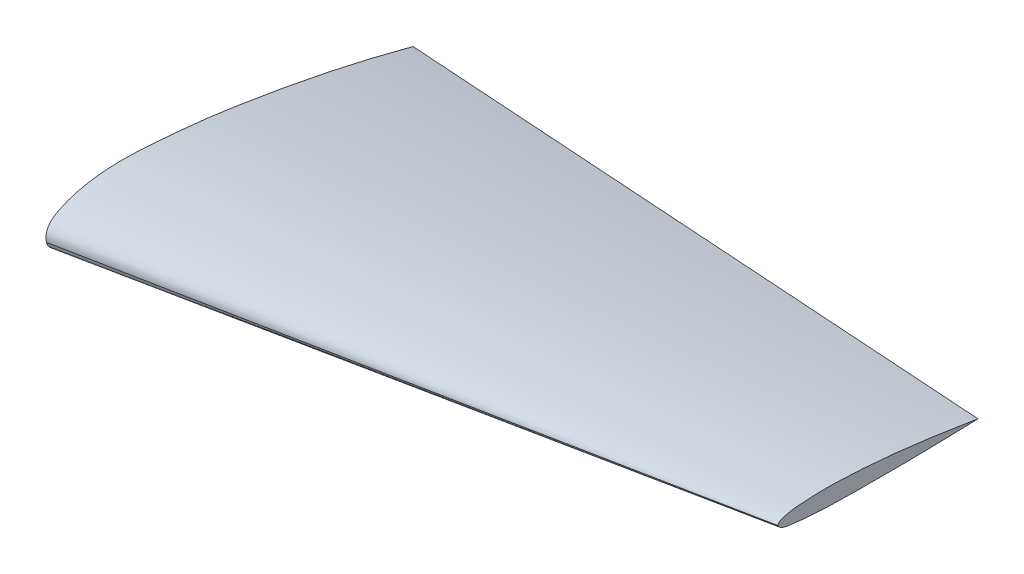
ISO-10303-21;
HEADER;
FILE_DESCRIPTION(('STEP AP214'),'2;1');
FILE_NAME('part.step','',(''),(''),'','','');
FILE_SCHEMA(('AUTOMOTIVE_DESIGN { 1 0 10303 214 1 1 1 1 }'));
ENDSEC;
DATA;
#1=APPLICATION_CONTEXT('core data for automotive mechanical design processes');
#2=APPLICATION_PROTOCOL_DEFINITION('international standard','automotive_design',2000,#1);
#3=PRODUCT_CONTEXT('',#1,'mechanical');
#4=PRODUCT('Part','Part','',(#3));
#5=PRODUCT_RELATED_PRODUCT_CATEGORY('part','',(#4));
#6=PRODUCT_DEFINITION_FORMATION('','',#4);
#7=PRODUCT_DEFINITION_CONTEXT('part definition',#1,'design');
#8=PRODUCT_DEFINITION('design','',#6,#7);
#9=PRODUCT_DEFINITION_SHAPE('','',#8);
#10=(LENGTH_UNIT() NAMED_UNIT(*) SI_UNIT(.MILLI.,.METRE.));
#11=(NAMED_UNIT(*) PLANE_ANGLE_UNIT() SI_UNIT($,.RADIAN.));
#12=(NAMED_UNIT(*) SI_UNIT($,.STERADIAN.) SOLID_ANGLE_UNIT());
#13=UNCERTAINTY_MEASURE_WITH_UNIT(LENGTH_MEASURE(1.E-05),#10,'distance_accuracy_value','');
#14=(GEOMETRIC_REPRESENTATION_CONTEXT(3) GLOBAL_UNCERTAINTY_ASSIGNED_CONTEXT((#13)) GLOBAL_UNIT_ASSIGNED_CONTEXT((#10,
#11,#12)) REPRESENTATION_CONTEXT('',''));
#15=CARTESIAN_POINT('',(0.,0.,0.));
#16=DIRECTION('',(0.,0.,1.));
#17=DIRECTION('',(1.,0.,0.));
#18=AXIS2_PLACEMENT_3D('',#15,#16,#17);
#19=CARTESIAN_POINT('',(497.812961596189,46.8598992347078,-41.7997404423216));
#20=DIRECTION('',(-0.994880708828789,-0.101056297182943,0.));
#21=DIRECTION('',(0.101056297182943,-0.994880708828789,0.));
#22=AXIS2_PLACEMENT_3D('',#19,#20,#21);
#23=PLANE('',#22);
#24=CARTESIAN_POINT('',(497.565765082102,49.293503572191,-39.1503361906483));
#25=CARTESIAN_POINT('',(497.874664280768,46.2524476232544,-40.3563670015449));
#26=CARTESIAN_POINT('',(497.936752741116,45.6411981201315,-47.3358915755482));
#27=B_SPLINE_CURVE_WITH_KNOTS('',2,(#24,#25,#26),.UNSPECIFIED.,.F.,.F.,(3,3),(0.,1.),.UNSPECIFIED.);
#28=CARTESIAN_POINT('',(497.565765082102,49.293503572191,-39.1503361906483));
#29=VERTEX_POINT('',#28);
#30=CARTESIAN_POINT('',(497.936752741116,45.6411981201315,-47.3358915755482));
#31=VERTEX_POINT('',#30);
#32=EDGE_CURVE('E132',#29,#31,#27,.T.);
#33=ORIENTED_EDGE('',*,*,#32,.T.);
#34=CARTESIAN_POINT('',(497.936752741116,45.6411981201315,-47.3358915755482));
#35=CARTESIAN_POINT('',(498.035859563674,44.6655096313851,-53.9145226808806));
#36=CARTESIAN_POINT('',(498.155969729885,43.4830470770631,-69.2736720951361));
#37=CARTESIAN_POINT('',(498.248813242058,42.5690197301683,-115.379755581491));
#38=CARTESIAN_POINT('',(498.175857150927,43.2872590648873,-154.843733905706));
#39=CARTESIAN_POINT('',(498.085240476994,44.1793635977852,-185.550116988422));
#40=B_SPLINE_CURVE_WITH_KNOTS('',3,(#34,#35,#36,#37,#38,#39),.UNSPECIFIED.,.F.,.F.,(4,1,1,4),
(0.,0.144207120424887,0.333735958857241,1.),.UNSPECIFIED.);
#41=CARTESIAN_POINT('',(498.085240476994,44.1793635977852,-185.550116988422));
#42=VERTEX_POINT('',#41);
#43=EDGE_CURVE('E96',#31,#42,#40,.T.);
#44=ORIENTED_EDGE('',*,*,#43,.T.);
#45=CARTESIAN_POINT('',(498.085240476994,44.1793635977852,-185.550116988422));
#46=CARTESIAN_POINT('',(497.58137622044,49.1398147788292,-153.150247387652));
#47=CARTESIAN_POINT('',(497.084942188327,54.0271167632032,-114.367952862237));
#48=CARTESIAN_POINT('',(496.99388070064,54.9236004059143,-72.5953760224991));
#49=CARTESIAN_POINT('',(497.041638641729,54.4534322362163,-62.2728730299402));
#50=CARTESIAN_POINT('',(497.066225567092,54.2113784660382,-57.3335564788497));
#51=CARTESIAN_POINT('',(497.098626159356,53.8924005784969,-52.8332974812691));
#52=CARTESIAN_POINT('',(497.146819349563,53.4179474610716,-48.5298851082864));
#53=CARTESIAN_POINT('',(497.28783667777,52.0296577319373,-43.3343131448148));
#54=CARTESIAN_POINT('',(497.349104469334,51.4264875624533,-40.0374706566867));
#55=CARTESIAN_POINT('',(497.565765082102,49.293503572191,-39.1503361906483));
#56=B_SPLINE_CURVE_WITH_KNOTS('',3,(#45,#46,#47,#48,#49,#50,#51,#52,#53,#54,#55),.UNSPECIFIED.,
.F.,.F.,(4,1,1,1,1,1,1,1,4),(0.,0.663278483078497,0.789901318390988,0.845042139935249,
0.872447262978047,0.889975943276836,0.93646680469086,0.959288030911908,1.),.UNSPECIFIED.);
#57=EDGE_CURVE('E13',#42,#29,#56,.T.);
#58=ORIENTED_EDGE('',*,*,#57,.T.);
#59=EDGE_LOOP('',(#33,#44,#58));
#60=FACE_BOUND('',#59,.T.);
#61=ADVANCED_FACE('F85',(#60),#23,.F.);
#62=CARTESIAN_POINT('',(1.93565698936111,-19.0561879992368,-132.16033294956));
#63=DIRECTION('',(-0.994880708828788,-0.101056297182947,0.));
#64=DIRECTION('',(0.101056297182947,-0.994880708828788,0.));
#65=AXIS2_PLACEMENT_3D('',#62,#63,#64);
#66=PLANE('',#65);
#67=CARTESIAN_POINT('',(0.,0.,0.));
#68=CARTESIAN_POINT('',(0.295492387968501,-2.90906835685271,-0.35876333784435));
#69=CARTESIAN_POINT('',(0.665790830602936,-6.55458860008315,-5.06532576757915));
#70=CARTESIAN_POINT('',(0.87728935351635,-8.6367527626134,-12.877561278132));
#71=CARTESIAN_POINT('',(1.11263016034805,-10.9536398368864,-22.7936289359379));
#72=CARTESIAN_POINT('',(1.43094098136978,-14.0873514815222,-39.4661136079355));
#73=CARTESIAN_POINT('',(1.84532363366468,-18.1668726824145,-68.0351207660252));
#74=CARTESIAN_POINT('',(2.11125031694814,-20.784872099933,-146.277976918582));
#75=CARTESIAN_POINT('',(1.58413584602016,-15.5955268231972,-214.425278522347));
#76=CARTESIAN_POINT('',(0.920996280038115,-9.06703943698049,-268.125155406389));
#77=B_SPLINE_CURVE_WITH_KNOTS('',3,(#67,#68,#69,#70,#71,#72,#73,#74,#75,#76),.UNSPECIFIED.,.F.,
.F.,(4,1,1,1,1,1,1,4),(0.,0.0280496216970074,0.063044894401088,0.0881538683664813,
0.140266216656083,0.249519911793771,0.40531187282759,1.),.UNSPECIFIED.);
#78=CARTESIAN_POINT('',(0.,0.,0.));
#79=VERTEX_POINT('',#78);
#80=CARTESIAN_POINT('',(0.880787108732498,-8.67118752111689,-13.191865456169));
#81=VERTEX_POINT('',#80);
#82=EDGE_CURVE('E129',#79,#81,#77,.T.);
#83=ORIENTED_EDGE('',*,*,#82,.F.);
#84=CARTESIAN_POINT('',(0.920996280038115,-9.06703943698049,-268.125155406389));
#85=CARTESIAN_POINT('',(-0.102345335747065,1.00757105704189,-228.03520791426));
#86=CARTESIAN_POINT('',(-1.09921492576154,10.8215693131627,-176.281457407701));
#87=CARTESIAN_POINT('',(-1.88813426734725,18.5883355181883,-117.767038523798));
#88=CARTESIAN_POINT('',(-2.18250152409081,21.4863271645163,-82.5743967443924));
#89=CARTESIAN_POINT('',(-2.42356311630646,23.8595343215204,-51.3959117621206));
#90=CARTESIAN_POINT('',(-1.9702103547437,19.3963595432429,-24.2426808011256));
#91=CARTESIAN_POINT('',(-1.43121040683339,14.0900039257903,-8.58170594546651));
#92=CARTESIAN_POINT('',(-0.895131695886061,8.81240735039045,1.13298680350425));
#93=CARTESIAN_POINT('',(0.,0.,0.));
#94=B_SPLINE_CURVE_WITH_KNOTS('',3,(#84,#85,#86,#87,#88,#89,#90,#91,#92,#93),.UNSPECIFIED.,.F.,
.F.,(4,1,1,1,1,1,1,4),(0.,0.442526100433621,0.563176534155046,0.631552305396863,
0.820652477413212,0.896362766175291,0.922313846313062,1.),.UNSPECIFIED.);
#95=CARTESIAN_POINT('',(0.920996280038115,-9.06703943698049,-268.125155406389));
#96=VERTEX_POINT('',#95);
#97=EDGE_CURVE('E137',#96,#79,#94,.T.);
#98=ORIENTED_EDGE('',*,*,#97,.F.);
#99=EDGE_CURVE('E150',#81,#96,#77,.T.);
#100=ORIENTED_EDGE('',*,*,#99,.F.);
#101=EDGE_LOOP('',(#83,#98,#100));
#102=FACE_BOUND('',#101,.T.);
#103=ADVANCED_FACE('F149',(#102),#66,.T.);
#104=CARTESIAN_POINT('',(0.920996280038115,-9.06703943698049,-268.125155406389));
#105=CARTESIAN_POINT('',(166.642411012357,8.68176157460807,-240.6001426004));
#106=CARTESIAN_POINT('',(332.363825744675,26.4305625861966,-213.075129794411));
#107=CARTESIAN_POINT('',(498.085240476994,44.1793635977852,-185.550116988422));
#108=CARTESIAN_POINT('',(0.77646502883304,-7.64415578049241,-262.463067416996));
#109=CARTESIAN_POINT('',(166.530230653808,9.78615662707574,-235.807749280121));
#110=CARTESIAN_POINT('',(332.283996278783,27.2164690346439,-209.152431143246));
#111=CARTESIAN_POINT('',(498.037761903758,44.646781442212,-182.49711300637));
#112=CARTESIAN_POINT('',(0.496977143370228,-4.89264881507369,-251.115784940589));
#113=CARTESIAN_POINT('',(166.312768691294,11.9270297585956,-226.20662540309));
#114=CARTESIAN_POINT('',(332.128560239217,28.746708332265,-201.297465865592));
#115=CARTESIAN_POINT('',(497.94435178714,45.5663869059343,-176.388306328093));
#116=CARTESIAN_POINT('',(0.105483463130705,-1.0384653455015,-234.031630356761));
#117=CARTESIAN_POINT('',(166.00694998127,14.9377588618977,-211.759609260868));
#118=CARTESIAN_POINT('',(331.90841649941,30.9139830692969,-189.487588164975));
#119=CARTESIAN_POINT('',(497.809883017549,46.8902072766961,-167.215567069082));
#120=CARTESIAN_POINT('',(-0.259283660801802,2.55260007972814,-216.888237202004));
#121=CARTESIAN_POINT('',(165.721178309644,17.75112854946,-197.270458376728));
#122=CARTESIAN_POINT('',(331.701640280089,32.9496570191918,-177.652679551453));
#123=CARTESIAN_POINT('',(497.682102250534,48.1481854889236,-158.034900726177));
#124=CARTESIAN_POINT('',(-0.598292216704141,5.89007712764097,-199.693319292693));
#125=CARTESIAN_POINT('',(165.455134859352,20.3702775167459,-182.743254358451));
#126=CARTESIAN_POINT('',(331.508561935409,34.8504779058508,-165.793189424209));
#127=CARTESIAN_POINT('',(497.561989011465,49.3306782949557,-148.843124489968));
#128=CARTESIAN_POINT('',(-0.860203131053554,8.46854203662354,-185.321993509226));
#129=CARTESIAN_POINT('',(165.249593982825,22.3937897434302,-170.607446659235));
#130=CARTESIAN_POINT('',(331.359391096704,36.3190374502369,-155.892899809245));
#131=CARTESIAN_POINT('',(497.469188210582,50.2442851570436,-141.178352959254));
#132=CARTESIAN_POINT('',(-1.05783236687401,10.4141656117918,-173.806351554052));
#133=CARTESIAN_POINT('',(165.094705602678,23.9186374345252,-160.883981583357));
#134=CARTESIAN_POINT('',(331.247243572229,37.4231092572587,-147.961611612661));
#135=CARTESIAN_POINT('',(497.399781541781,50.9275810799922,-135.039241641965));
#136=CARTESIAN_POINT('',(-1.20024305664856,11.8161727299747,-165.159154080303));
#137=CARTESIAN_POINT('',(164.983272933825,25.0156716190879,-153.58414420327));
#138=CARTESIAN_POINT('',(331.166788924299,38.2151705082011,-142.009134326237));
#139=CARTESIAN_POINT('',(497.350304914772,51.4146693973143,-130.434124449204));
#140=CARTESIAN_POINT('',(-1.33698102007106,13.16233289778,-156.500315256014));
#141=CARTESIAN_POINT('',(164.876514345094,26.0666903422214,-146.275440008501));
#142=CARTESIAN_POINT('',(331.09000971026,38.9710477866627,-136.050564760988));
#143=CARTESIAN_POINT('',(497.303505075425,51.8754052311041,-125.825689513476));
#144=CARTESIAN_POINT('',(-1.46816922730418,14.4538567339027,-147.833667312522));
#145=CARTESIAN_POINT('',(164.774395671198,27.0720299549167,-138.960914561308));
#146=CARTESIAN_POINT('',(331.016960569701,39.6902031759307,-130.088161810095));
#147=CARTESIAN_POINT('',(497.259525468203,52.3083763969448,-121.215409058882));
#148=CARTESIAN_POINT('',(-1.59393064851061,15.6919548570375,-139.163042481164));
#149=CARTESIAN_POINT('',(164.676874895388,28.0321041043574,-131.642843176499));
#150=CARTESIAN_POINT('',(330.947680439287,40.3722533516774,-124.122643871835));
#151=CARTESIAN_POINT('',(497.218485983186,52.7124025989973,-116.60244456717));
#152=CARTESIAN_POINT('',(-1.71247330893653,16.8589856044385,-130.478803277993));
#153=CARTESIAN_POINT('',(164.585189777445,28.9347272725423,-124.314953296395));
#154=CARTESIAN_POINT('',(330.882852863826,41.010468940646,-118.151103314798));
#155=CARTESIAN_POINT('',(497.180515950208,53.0862106087498,-111.9872533332));
#156=CARTESIAN_POINT('',(-1.82115289698038,17.928916213439,-121.786910105332));
#157=CARTESIAN_POINT('',(164.501146553028,29.762117400733,-116.981113446615));
#158=CARTESIAN_POINT('',(330.823446003036,41.595318588027,-112.175316787898));
#159=CARTESIAN_POINT('',(497.145745453044,53.4285197753209,-107.369520129181));
#160=CARTESIAN_POINT('',(-1.91766845582399,18.8790941862327,-113.081912393248));
#161=CARTESIAN_POINT('',(164.426318864712,30.4987822664193,-109.637770631976));
#162=CARTESIAN_POINT('',(330.770306185249,42.1184703466058,-106.193628870704));
#163=CARTESIAN_POINT('',(497.114293505785,53.7381584267924,-102.749487109432));
#164=CARTESIAN_POINT('',(-1.99969093916126,19.6865904891574,-104.365043139685));
#165=CARTESIAN_POINT('',(164.362307700104,31.1289604403103,-102.28563858497));
#166=CARTESIAN_POINT('',(330.724306339369,42.5713303914632,-100.206234030256));
#167=CARTESIAN_POINT('',(497.086304978634,54.0137003426161,-98.1268294755411));
#168=CARTESIAN_POINT('',(-2.07270600556063,20.405410424575,-95.6345034780606));
#169=CARTESIAN_POINT('',(164.305487024109,31.6883495727592,-94.9236777884789));
#170=CARTESIAN_POINT('',(330.683680053779,42.9712887209434,-94.2128520988972));
#171=CARTESIAN_POINT('',(497.061873083449,54.2542278691276,-93.5020264093155));
#172=CARTESIAN_POINT('',(-2.14423493921038,21.1095996556765,-86.8943930814379));
#173=CARTESIAN_POINT('',(164.25090789569,32.2256710804944,-87.5543303345044));
#174=CARTESIAN_POINT('',(330.64605073059,43.3417425053123,-88.2142675875709));
#175=CARTESIAN_POINT('',(497.041193565491,54.4578139301301,-88.8742048406374));
#176=CARTESIAN_POINT('',(-2.20863019647684,21.7435591513276,-78.1411175701846));
#177=CARTESIAN_POINT('',(164.202324005609,32.7039705665179,-80.1756909141569));
#178=CARTESIAN_POINT('',(330.613278207695,43.6643819817083,-82.2102642581291));
#179=CARTESIAN_POINT('',(497.024232409781,54.6247933968986,-84.2448376021013));
#180=CARTESIAN_POINT('',(-2.24891434292648,22.1401491837314,-70.8459960796845));
#181=CARTESIAN_POINT('',(164.17217554374,33.0007766434301,-74.0254276172008));
#182=CARTESIAN_POINT('',(330.593265430405,43.8614041031287,-77.2048591547171));
#183=CARTESIAN_POINT('',(497.014355317071,54.7220315628274,-80.3842906922334));
#184=CARTESIAN_POINT('',(-2.26921352743584,22.3399909317103,-65.0026149690954));
#185=CARTESIAN_POINT('',(164.157173680575,33.1484672344701,-69.1008008788109));
#186=CARTESIAN_POINT('',(330.583560888586,43.95694353723,-73.1989867885265));
#187=CARTESIAN_POINT('',(497.009948096597,54.7654198399898,-77.2971726982421));
#188=CARTESIAN_POINT('',(-2.27744014489834,22.4209804716053,-60.6202348742599));
#189=CARTESIAN_POINT('',(164.151228849375,33.2069930071635,-65.4071772218515));
#190=CARTESIAN_POINT('',(330.579897843648,43.9930055427216,-70.1941195694431));
#191=CARTESIAN_POINT('',(497.008566837921,54.7790180782797,-74.9810619170347));
#192=CARTESIAN_POINT('',(-2.27763528684695,22.4229016082943,-56.2418082147318));
#193=CARTESIAN_POINT('',(164.151365248917,33.2056501786916,-61.7164584231166));
#194=CARTESIAN_POINT('',(330.580365784681,43.9883987490889,-67.1911086315014));
#195=CARTESIAN_POINT('',(497.009366320445,54.7711473194862,-72.6657588398862));
#196=CARTESIAN_POINT('',(-2.26877270819311,22.3356511471259,-51.8619519101604));
#197=CARTESIAN_POINT('',(164.158320526351,33.1371767481732,-58.0248151430539));
#198=CARTESIAN_POINT('',(330.585413760895,43.9387023492204,-64.1876783759473));
#199=CARTESIAN_POINT('',(497.012506995439,54.7402279502677,-70.3505416088407));
#200=CARTESIAN_POINT('',(-2.24982616384823,22.1491258934491,-47.4752828801953));
#201=CARTESIAN_POINT('',(164.172886320846,32.9937791731944,-54.3288932436395));
#202=CARTESIAN_POINT('',(330.595598805541,43.8384324529398,-61.1825036070837));
#203=CARTESIAN_POINT('',(497.018311290236,54.6830857326852,-68.0361139705279));
#204=CARTESIAN_POINT('',(-2.21982275589176,21.8537478456963,-43.0911243357445));
#205=CARTESIAN_POINT('',(164.195652463767,32.7696506721758,-50.6348123451572));
#206=CARTESIAN_POINT('',(330.611127683426,43.6855534986553,-58.17850035457));
#207=CARTESIAN_POINT('',(497.026602903085,54.6014563251348,-65.7221883639827));
#208=CARTESIAN_POINT('',(-2.17778958640313,21.4399390023003,-38.7187994877162));
#209=CARTESIAN_POINT('',(164.226998474076,32.4610549505412,-46.9487499732906));
#210=CARTESIAN_POINT('',(330.631786534554,43.4821708987821,-55.178700458865));
#211=CARTESIAN_POINT('',(497.036574595033,54.503286847023,-63.4086509444394));
#212=CARTESIAN_POINT('',(-2.12236298579425,20.8942742863063,-34.3404645804896));
#213=CARTESIAN_POINT('',(164.267637729426,32.0609689361528,-43.2587135442832));
#214=CARTESIAN_POINT('',(330.657638444646,43.2276635859992,-52.1769625080768));
#215=CARTESIAN_POINT('',(497.047639159866,54.3943582358456,-61.0952114718704));
#216=CARTESIAN_POINT('',(-2.05175171501499,20.1991192778362,-29.9976846169514));
#217=CARTESIAN_POINT('',(164.318485557525,31.5603813956238,-39.592350523515));
#218=CARTESIAN_POINT('',(330.688722830064,42.9216435134114,-49.1870164300787));
#219=CARTESIAN_POINT('',(497.058960102604,54.282905631199,-58.7816823366423));
#220=CARTESIAN_POINT('',(-1.96440864662558,19.3392427910376,-25.6972134143154));
#221=CARTESIAN_POINT('',(164.381155130325,30.9434109470005,-35.9548774198435));
#222=CARTESIAN_POINT('',(330.726718907276,42.5475791029633,-46.2125414253715));
#223=CARTESIAN_POINT('',(497.072282684226,54.1517472589262,-56.4702054308995));
#224=CARTESIAN_POINT('',(-1.85835954805921,18.2952088684276,-21.4581634765625));
#225=CARTESIAN_POINT('',(164.457543393116,30.1913825118575,-32.3597949553346));
#226=CARTESIAN_POINT('',(330.773446334291,42.0875561552874,-43.2614264341067));
#227=CARTESIAN_POINT('',(497.089349275466,53.9837297987174,-54.1630579128787));
#228=CARTESIAN_POINT('',(-1.73252646555327,17.0564052529439,-17.308989605429));
#229=CARTESIAN_POINT('',(164.548675922102,29.2941994805949,-28.821381685002));
#230=CARTESIAN_POINT('',(330.829878309757,41.5319937082458,-40.3337737645751));
#231=CARTESIAN_POINT('',(497.111080697412,53.7697879358967,-51.8461658441481));
#232=CARTESIAN_POINT('',(-1.60737064479528,15.8242691551375,-13.8776876486494));
#233=CARTESIAN_POINT('',(164.64047952104,28.3904098887477,-25.8947493000122));
#234=CARTESIAN_POINT('',(330.888329686875,40.9565506223579,-37.9118109513751));
#235=CARTESIAN_POINT('',(497.13617985271,53.5226913559681,-49.9288726027379));
#236=CARTESIAN_POINT('',(-1.4920405828903,14.6888658508826,-11.0830713438544));
#237=CARTESIAN_POINT('',(164.726047475868,27.5480090693477,-23.5246845983974));
#238=CARTESIAN_POINT('',(330.944135534627,40.4071522878128,-35.9662978529403));
#239=CARTESIAN_POINT('',(497.162223593385,53.2662955062779,-48.4079111074832));
#240=CARTESIAN_POINT('',(-1.39574829908302,13.7408859798657,-9.01543078467474));
#241=CARTESIAN_POINT('',(164.797926340206,26.8403748348094,-21.7700982408365));
#242=CARTESIAN_POINT('',(330.991600979495,39.9398636897532,-34.5247656969982));
#243=CARTESIAN_POINT('',(497.185275618784,53.0393525446969,-47.2794331531599));
#244=CARTESIAN_POINT('',(-1.28746924316792,12.6748985362024,-7.02922093401371));
#245=CARTESIAN_POINT('',(164.879009162717,26.0421293203541,-20.0731330121883));
#246=CARTESIAN_POINT('',(331.045487568602,39.4093601045058,-33.1170450903628));
#247=CARTESIAN_POINT('',(497.211965974487,52.7765908886575,-46.1609571685373));
#248=CARTESIAN_POINT('',(-1.1649447063695,11.4686669463169,-5.17817133985858));
#249=CARTESIAN_POINT('',(164.97017780781,25.1445907326444,-18.4657750076634));
#250=CARTESIAN_POINT('',(331.10530032199,38.820514518972,-31.7533786754683));
#251=CARTESIAN_POINT('',(497.240422836169,52.4964383052995,-45.0409823432732));
#252=CARTESIAN_POINT('',(-1.02591597991226,10.0999546366332,-3.51601155019661));
#253=CARTESIAN_POINT('',(165.072124581948,24.1409434415262,-16.977915420882));
#254=CARTESIAN_POINT('',(331.170165143809,38.1819322464192,-30.4398192915675));
#255=CARTESIAN_POINT('',(497.268205705669,52.2229210513122,-43.9017231622529));
#256=CARTESIAN_POINT('',(-0.868151616442138,8.54679341726923,-2.09633748215695));
#257=CARTESIAN_POINT('',(165.186269153973,23.0172110676986,-15.6451028060611));
#258=CARTESIAN_POINT('',(331.240689924387,37.4876287181279,-29.1938681299652));
#259=CARTESIAN_POINT('',(497.295110694802,51.9580463685572,-42.7426334538693));
#260=CARTESIAN_POINT('',(-0.689420168605094,6.78721509834266,-0.972745052868695));
#261=CARTESIAN_POINT('',(165.317039097401,21.7298049620029,-14.5243145556904));
#262=CARTESIAN_POINT('',(331.323498363407,36.6723948256631,-28.075884058512));
#263=CARTESIAN_POINT('',(497.329957629413,51.6149846893234,-41.6274535613337));
#264=CARTESIAN_POINT('',(-0.487477514964948,4.79912671595755,-0.198880562171046));
#265=CARTESIAN_POINT('',(165.46844203911,20.2392707729977,-13.66957505777));
#266=CARTESIAN_POINT('',(331.424361593184,35.6794148300379,-27.1402695533689));
#267=CARTESIAN_POINT('',(497.380281147259,51.1195588870781,-40.6109640489678));
#268=CARTESIAN_POINT('',(-0.26007953408553,2.56043530621799,0.171609690096772));
#269=CARTESIAN_POINT('',(165.644649315846,18.504542455539,-13.1360429733857));
#270=CARTESIAN_POINT('',(331.549378165778,34.44864960486,-26.4436956368682));
#271=CARTESIAN_POINT('',(497.45410701571,50.392756754181,-39.7513483003507));
#272=CARTESIAN_POINT('',(-0.0900188262929223,0.886218832539525,0.113938700557202));
#273=CARTESIAN_POINT('',(165.781383644364,17.1584180727084,-13.0308990430162));
#274=CARTESIAN_POINT('',(331.65278611502,33.4306173128772,-26.1757367865895));
#275=CARTESIAN_POINT('',(497.524188585677,49.702816553046,-39.3205745301629));
#276=CARTESIAN_POINT('',(0.,0.,0.));
#277=CARTESIAN_POINT('',(165.855255027367,16.431167857397,-13.0501120635494));
#278=CARTESIAN_POINT('',(331.710510054735,32.862335714794,-26.1002241270989));
#279=CARTESIAN_POINT('',(497.565765082102,49.293503572191,-39.1503361906483));
#280=B_SPLINE_SURFACE_WITH_KNOTS('',3,3,((#104,#105,#106,#107),(#108,#109,#110,#111),(#112,#113,
#114,#115),(#116,#117,#118,#119),(#120,#121,#122,#123),(#124,#125,#126,#127),(#128,#129,#130,
#131),(#132,#133,#134,#135),(#136,#137,#138,#139),(#140,#141,#142,#143),(#144,#145,#146,#147),
(#148,#149,#150,#151),(#152,#153,#154,#155),(#156,#157,#158,#159),(#160,#161,#162,#163),(#164,
#165,#166,#167),(#168,#169,#170,#171),(#172,#173,#174,#175),(#176,#177,#178,#179),(#180,#181,
#182,#183),(#184,#185,#186,#187),(#188,#189,#190,#191),(#192,#193,#194,#195),(#196,#197,#198,
#199),(#200,#201,#202,#203),(#204,#205,#206,#207),(#208,#209,#210,#211),(#212,#213,#214,#215),
(#216,#217,#218,#219),(#220,#221,#222,#223),(#224,#225,#226,#227),(#228,#229,#230,#231),(#232,
#233,#234,#235),(#236,#237,#238,#239),(#240,#241,#242,#243),(#244,#245,#246,#247),(#248,#249,
#250,#251),(#252,#253,#254,#255),(#256,#257,#258,#259),(#260,#261,#262,#263),(#264,#265,#266,
#267),(#268,#269,#270,#271),(#272,#273,#274,#275),(#276,#277,#278,#279)),.UNSPECIFIED.,.F.,.F.,
.F.,(4,1,1,1,1,1,1,1,1,1,1,1,1,1,1,1,1,1,1,1,1,1,1,1,1,1,1,1,1,1,1,1,1,1,1,1,1,1,1,1,1,4),(4,4),
(0.495964472106031,0.527466692599404,0.558968913092778,0.590471133586151,0.621973354079524,
0.653475574572897,0.669226684819583,0.68497779506627,0.700728905312956,0.716480015559643,
0.732231125806329,0.747982236053016,0.763733346299702,0.779484456546389,0.795235566793075,
0.810986677039762,0.826737787286448,0.842488897533135,0.858240007779821,0.866115562903165,
0.873991118026508,0.881866673149851,0.889742228273194,0.897617783396538,0.905493338519881,
0.913368893643224,0.921244448766567,0.929120003889911,0.936995559013254,0.944871114136597,
0.95274666925994,0.960622224383284,0.964560001944955,0.968497779506627,0.972435557068299,
0.97637333462997,0.980311112191642,0.984248889753313,0.988186667314985,0.992124444876657,
0.996062222438328,1.),(0.,1.),.UNSPECIFIED.);
#281=CARTESIAN_POINT('',(0.,0.,0.));
#282=CARTESIAN_POINT('',(165.855255027367,16.431167857397,-13.0501120635494));
#283=CARTESIAN_POINT('',(331.710510054735,32.862335714794,-26.1002241270989));
#284=CARTESIAN_POINT('',(497.565765082102,49.293503572191,-39.1503361906483));
#285=B_SPLINE_CURVE_WITH_KNOTS('',3,(#281,#282,#283,#284),.UNSPECIFIED.,.F.,.F.,(4,4),(0.,1.),.UNSPECIFIED.);
#286=EDGE_CURVE('E124',#79,#29,#285,.T.);
#287=CARTESIAN_POINT('',(0.920996280038115,-9.06703943698049,-268.125155406389));
#288=CARTESIAN_POINT('',(166.642411012357,8.68176157460807,-240.6001426004));
#289=CARTESIAN_POINT('',(332.363825744675,26.4305625861966,-213.075129794411));
#290=CARTESIAN_POINT('',(498.085240476994,44.1793635977852,-185.550116988422));
#291=B_SPLINE_CURVE_WITH_KNOTS('',3,(#287,#288,#289,#290),.UNSPECIFIED.,.F.,.F.,(4,4),(0.,1.),.UNSPECIFIED.);
#292=EDGE_CURVE('E104',#96,#42,#291,.T.);
#293=ORIENTED_EDGE('',*,*,#97,.T.);
#294=ORIENTED_EDGE('',*,*,#286,.T.);
#295=ORIENTED_EDGE('',*,*,#57,.F.);
#296=ORIENTED_EDGE('',*,*,#292,.F.);
#297=EDGE_LOOP('',(#293,#294,#295,#296));
#298=FACE_BOUND('',#297,.T.);
#299=ADVANCED_FACE('F139',(#298),#280,.T.);
#300=CARTESIAN_POINT('',(0.880787108732498,-8.67118752111689,-13.191865456169));
#301=CARTESIAN_POINT('',(166.566108986194,9.43294102596592,-24.5732074959621));
#302=CARTESIAN_POINT('',(332.251430863655,27.5370695730487,-35.9545495357551));
#303=CARTESIAN_POINT('',(497.936752741116,45.6411981201315,-47.3358915755482));
#304=CARTESIAN_POINT('',(0.946835707017884,-9.32142385582401,-15.7877989092718));
#305=CARTESIAN_POINT('',(166.617300273821,8.9289721893869,-26.7790310720406));
#306=CARTESIAN_POINT('',(332.287764840623,27.1793682345978,-37.7702632348093));
#307=CARTESIAN_POINT('',(497.958229407426,45.4297642798087,-48.761495397578));
#308=CARTESIAN_POINT('',(1.06961168159168,-10.5301308044865,-20.9738823832661));
#309=CARTESIAN_POINT('',(166.711995667609,7.99671340768202,-31.1886284680215));
#310=CARTESIAN_POINT('',(332.354379653627,26.5235576198505,-41.4033745527769));
#311=CARTESIAN_POINT('',(497.996763639645,45.050401832019,-51.6181206375323));
#312=CARTESIAN_POINT('',(1.22839142524771,-12.0932882555277,-28.8226121437118));
#313=CARTESIAN_POINT('',(166.833299502317,6.80249940596077,-37.8538162978887));
#314=CARTESIAN_POINT('',(332.438207579387,25.6982870674492,-46.8850204520656));
#315=CARTESIAN_POINT('',(498.043115656457,44.5940747289377,-55.9162246062425));
#316=CARTESIAN_POINT('',(1.36939389172526,-13.4814316736646,-36.7101814910355));
#317=CARTESIAN_POINT('',(166.939538031631,5.75660057238869,-44.5482569956326));
#318=CARTESIAN_POINT('',(332.509682171537,24.994632818442,-52.3863325002297));
#319=CARTESIAN_POINT('',(498.079826311444,44.2326650644953,-60.2244080048268));
#320=CARTESIAN_POINT('',(1.49800799851079,-14.7476139630525,-44.6168249335639));
#321=CARTESIAN_POINT('',(167.03497249763,4.81706576035062,-51.2575899486136));
#322=CARTESIAN_POINT('',(332.571936996748,24.3817454837537,-57.8983549636633));
#323=CARTESIAN_POINT('',(498.108901495867,43.9464252071569,-64.539119978713));
#324=CARTESIAN_POINT('',(1.6110167585228,-15.8601644759718,-52.5443761601205));
#325=CARTESIAN_POINT('',(167.118126872679,3.99842619114782,-57.9818539978567));
#326=CARTESIAN_POINT('',(332.625236986835,23.8570168582675,-63.419331835593));
#327=CARTESIAN_POINT('',(498.132347100991,43.7156075253872,-68.8568096733292));
#328=CARTESIAN_POINT('',(1.70751776976982,-16.8101992303456,-60.4913572090507));
#329=CARTESIAN_POINT('',(167.188719018088,3.30345946844122,-64.7196914059487));
#330=CARTESIAN_POINT('',(332.669920266405,23.417118167228,-68.9480256028466));
#331=CARTESIAN_POINT('',(498.151121514723,43.5307768660148,-73.1763597997446));
#332=CARTESIAN_POINT('',(1.78476367204177,-17.570670968859,-68.4562503626506));
#333=CARTESIAN_POINT('',(167.245236823019,2.74705204605019,-71.4697179314431));
#334=CARTESIAN_POINT('',(332.705709973997,23.0647750609594,-74.4831855002356));
#335=CARTESIAN_POINT('',(498.166183124975,43.3824980758686,-77.4966530690281));
#336=CARTESIAN_POINT('',(1.86346755478204,-18.3454962576429,-79.1001630543722));
#337=CARTESIAN_POINT('',(167.302936661735,2.1790077178788,-80.4861621891227));
#338=CARTESIAN_POINT('',(332.742405768688,22.7035116934005,-81.8721613238732));
#339=CARTESIAN_POINT('',(498.181874875641,43.2280156689222,-83.2581604586237));
#340=CARTESIAN_POINT('',(1.92236093286699,-18.9252907619717,-92.4316986734337));
#341=CARTESIAN_POINT('',(167.346343150718,1.75167879597102,-91.7752568499601));
#342=CARTESIAN_POINT('',(332.770325368569,22.4286483539138,-91.1188150264866));
#343=CARTESIAN_POINT('',(498.19430758642,43.1056179118565,-90.4623732030131));
#344=CARTESIAN_POINT('',(1.94928663885474,-19.1903693983906,-108.453368741123));
#345=CARTESIAN_POINT('',(167.367329361288,1.54507340244533,-105.337986024543));
#346=CARTESIAN_POINT('',(332.785372083722,22.2805162032813,-102.222603307963));
#347=CARTESIAN_POINT('',(498.203414806156,43.0159590041172,-99.1072205913832));
#348=CARTESIAN_POINT('',(1.94950573412868,-19.1925263511736,-124.464872961905));
#349=CARTESIAN_POINT('',(167.368976493106,1.5288576918317,-118.894175036196));
#350=CARTESIAN_POINT('',(332.788447252084,22.250241734837,-113.323477110487));
#351=CARTESIAN_POINT('',(498.207918011062,42.9716257778423,-107.752779184778));
#352=CARTESIAN_POINT('',(1.92298932775901,-18.931477194416,-140.471686518879));
#353=CARTESIAN_POINT('',(167.351344616994,1.70244027790616,-132.447287246104));
#354=CARTESIAN_POINT('',(332.77969990623,22.3363577502283,-124.422887973329));
#355=CARTESIAN_POINT('',(498.208055195465,42.9702752225504,-116.398488700554));
#356=CARTESIAN_POINT('',(1.87164926471034,-18.4260436911014,-156.469177787395));
#357=CARTESIAN_POINT('',(167.315787627704,2.05249231518566,-145.994048143621));
#358=CARTESIAN_POINT('',(332.759925990698,22.5310283214728,-135.518918499847));
#359=CARTESIAN_POINT('',(498.204064353692,43.0095643277599,-125.043788856072));
#360=CARTESIAN_POINT('',(1.79652531894896,-17.6864622252004,-172.458017689329));
#361=CARTESIAN_POINT('',(167.263100743258,2.5711850281144,-159.534956546742));
#362=CARTESIAN_POINT('',(332.729676167567,22.8288322814292,-146.611895404155));
#363=CARTESIAN_POINT('',(498.196251591875,43.086479534744,-133.688834261568));
#364=CARTESIAN_POINT('',(1.69910784488289,-16.7274050624814,-188.436022256165));
#365=CARTESIAN_POINT('',(167.194379568637,3.24773238660452,-173.068608013202));
#366=CARTESIAN_POINT('',(332.689651292392,23.2228698356904,-157.701193770239));
#367=CARTESIAN_POINT('',(498.184923016146,43.1980072847763,-142.333779527277));
#368=CARTESIAN_POINT('',(1.5806469180681,-15.5611789674895,-204.40255201088));
#369=CARTESIAN_POINT('',(167.110551615835,4.07300320523186,-186.594491597818));
#370=CARTESIAN_POINT('',(332.640456313602,23.7071853779532,-168.786431184755));
#371=CARTESIAN_POINT('',(498.170361011368,43.3413675506746,-150.978370771692));
#372=CARTESIAN_POINT('',(1.44252170993927,-14.2013616300151,-220.356131060009));
#373=CARTESIAN_POINT('',(167.012630460762,5.03701901507554,-200.111538744442));
#374=CARTESIAN_POINT('',(332.582739211584,24.2753996601661,-179.866946428875));
#375=CARTESIAN_POINT('',(498.152847962407,43.5137803052567,-159.622354113307));
#376=CARTESIAN_POINT('',(1.28604186152555,-12.6608462257604,-236.295736614555));
#377=CARTESIAN_POINT('',(166.901587292774,6.13021863506739,-213.619059633343));
#378=CARTESIAN_POINT('',(332.517132724023,24.9212834958952,-190.942382652132));
#379=CARTESIAN_POINT('',(498.132678155271,43.712348356723,-168.26570567092));
#380=CARTESIAN_POINT('',(1.11255457891215,-10.952895751514,-252.220100080495));
#381=CARTESIAN_POINT('',(166.778418344599,7.34279433674847,-227.116200574773));
#382=CARTESIAN_POINT('',(332.444282110286,25.638484425011,-202.01230106905));
#383=CARTESIAN_POINT('',(498.110145875973,43.9341745132735,-176.908401563328));
#384=CARTESIAN_POINT('',(0.986442636787416,-9.71134681423509,-262.825424429333));
#385=CARTESIAN_POINT('',(166.688875399165,8.22432820952487,-236.106834270392));
#386=CARTESIAN_POINT('',(332.391308161543,26.1600032332848,-209.388244111451));
#387=CARTESIAN_POINT('',(498.09374092392,44.0956782570448,-182.669653952509));
#388=CARTESIAN_POINT('',(0.920996280038115,-9.06703943698049,-268.125155406389));
#389=CARTESIAN_POINT('',(166.642411012357,8.68176157460807,-240.6001426004));
#390=CARTESIAN_POINT('',(332.363825744675,26.4305625861966,-213.075129794411));
#391=CARTESIAN_POINT('',(498.085240476994,44.1793635977852,-185.550116988422));
#392=B_SPLINE_SURFACE_WITH_KNOTS('',3,3,((#300,#301,#302,#303),(#304,#305,#306,#307),(#308,#309,
#310,#311),(#312,#313,#314,#315),(#316,#317,#318,#319),(#320,#321,#322,#323),(#324,#325,#326,
#327),(#328,#329,#330,#331),(#332,#333,#334,#335),(#336,#337,#338,#339),(#340,#341,#342,#343),
(#344,#345,#346,#347),(#348,#349,#350,#351),(#352,#353,#354,#355),(#356,#357,#358,#359),(#360,
#361,#362,#363),(#364,#365,#366,#367),(#368,#369,#370,#371),(#372,#373,#374,#375),(#376,#377,
#378,#379),(#380,#381,#382,#383),(#384,#385,#386,#387),(#388,#389,#390,#391)),.UNSPECIFIED.,.F.,
.F.,.F.,(4,1,1,1,1,1,1,1,1,1,1,1,1,1,1,1,1,1,1,1,4),(4,4),(0.0310094793117781,
0.0455393228365985,0.060069166361419,0.0745990098862394,0.0891288534110598,0.10365869693588,
0.118188540460701,0.132718383985521,0.147248227510341,0.176307914559982,0.205367601609623,
0.234427288659264,0.263486975708905,0.292546662758546,0.321606349808186,0.350666036857827,
0.379725723907468,0.408785410957109,0.43784509800675,0.466904785056391,0.495964472106031),(0.,
1.),.UNSPECIFIED.);
#393=CARTESIAN_POINT('',(0.880787108732498,-8.67118752111689,-13.191865456169));
#394=CARTESIAN_POINT('',(166.566108986194,9.43294102596592,-24.5732074959621));
#395=CARTESIAN_POINT('',(332.251430863655,27.5370695730487,-35.9545495357551));
#396=CARTESIAN_POINT('',(497.936752741116,45.6411981201315,-47.3358915755482));
#397=B_SPLINE_CURVE_WITH_KNOTS('',3,(#393,#394,#395,#396),.UNSPECIFIED.,.F.,.F.,(4,4),(0.,1.),.UNSPECIFIED.);
#398=EDGE_CURVE('E144',#81,#31,#397,.T.);
#399=ORIENTED_EDGE('',*,*,#99,.T.);
#400=ORIENTED_EDGE('',*,*,#292,.T.);
#401=ORIENTED_EDGE('',*,*,#43,.F.);
#402=ORIENTED_EDGE('',*,*,#398,.F.);
#403=EDGE_LOOP('',(#399,#400,#401,#402));
#404=FACE_BOUND('',#403,.T.);
#405=ADVANCED_FACE('F232',(#404),#392,.T.);
#406=CARTESIAN_POINT('',(0.,0.,0.));
#407=CARTESIAN_POINT('',(165.855255027367,16.431167857397,-13.0501120635494));
#408=CARTESIAN_POINT('',(331.710510054735,32.862335714794,-26.1002241270989));
#409=CARTESIAN_POINT('',(497.565765082102,49.293503572191,-39.1503361906483));
#410=CARTESIAN_POINT('',(0.0802576710721178,-0.790122049896863,-0.097442476130777));
#411=CARTESIAN_POINT('',(165.917340674712,15.8199460477731,-13.1485745701615));
#412=CARTESIAN_POINT('',(331.754423678351,32.430014145443,-26.1997066641923));
#413=CARTESIAN_POINT('',(497.591506681991,49.0400822431129,-39.250838758223));
#414=CARTESIAN_POINT('',(0.221464036649618,-2.18027281727117,-0.548841189586851));
#415=CARTESIAN_POINT('',(166.027782336626,14.7326681447417,-13.5365556108595));
#416=CARTESIAN_POINT('',(331.834100636602,31.6456091067546,-26.5242700321322));
#417=CARTESIAN_POINT('',(497.640418936578,48.5585500687674,-39.5119844534048));
#418=CARTESIAN_POINT('',(0.385994350902401,-3.80004358100005,-1.8041944463433));
#419=CARTESIAN_POINT('',(166.159354394897,13.4373653655602,-14.5641711896537));
#420=CARTESIAN_POINT('',(331.932714438892,30.6747743121205,-27.3241479329642));
#421=CARTESIAN_POINT('',(497.706074482886,47.9121832586808,-40.0841246762746));
#422=CARTESIAN_POINT('',(0.513499383564589,-5.0553072390831,-3.4565273029029));
#423=CARTESIAN_POINT('',(166.263671986917,12.4103778072865,-15.9165803950158));
#424=CARTESIAN_POINT('',(332.013844590269,29.8760628536562,-28.3766334871286));
#425=CARTESIAN_POINT('',(497.764017193621,47.3417479000258,-40.8366865792415));
#426=CARTESIAN_POINT('',(0.615029231867527,-6.05484997182389,-5.3043230165511));
#427=CARTESIAN_POINT('',(166.348101844173,11.5791813497182,-17.4594387318025));
#428=CARTESIAN_POINT('',(332.081174456478,29.2132126712604,-29.614554447054));
#429=CARTESIAN_POINT('',(497.814247068784,46.8472439928025,-41.7696701623054));
#430=CARTESIAN_POINT('',(0.699227207996925,-6.88376360223247,-7.20725486557912));
#431=CARTESIAN_POINT('',(166.418406174789,10.8870481108487,-19.0991950522082));
#432=CARTESIAN_POINT('',(332.137585141582,28.6578598239298,-30.9911352388373));
#433=CARTESIAN_POINT('',(497.856764108374,46.428671537011,-42.8830754254664));
#434=CARTESIAN_POINT('',(0.768945800636092,-7.57013035815895,-9.1722218277208));
#435=CARTESIAN_POINT('',(166.476486637888,10.3152566054444,-20.8404486747221));
#436=CARTESIAN_POINT('',(332.184027475141,28.2006435690478,-32.5086755217233));
#437=CARTESIAN_POINT('',(497.891568312393,46.0860305326511,-44.1769023687245));
#438=CARTESIAN_POINT('',(0.82843752901762,-8.15581551140094,-11.1705285517214));
#439=CARTESIAN_POINT('',(166.525178246291,9.83589665230699,-22.6640693651742));
#440=CARTESIAN_POINT('',(332.221918963565,27.8276088160149,-34.1576101786269));
#441=CARTESIAN_POINT('',(497.918659680838,45.8193209797228,-45.6511509920797));
#442=CARTESIAN_POINT('',(0.863639993672627,-8.50237731867845,-12.5179258001632));
#443=CARTESIAN_POINT('',(166.5529528967,9.56246031378941,-23.930038709347));
#444=CARTESIAN_POINT('',(332.242265799727,27.6272979462573,-35.3421516185308));
#445=CARTESIAN_POINT('',(497.931578702753,45.6921355787251,-46.7542645277146));
#446=CARTESIAN_POINT('',(0.880787108732498,-8.67118752111689,-13.191865456169));
#447=CARTESIAN_POINT('',(166.566108986194,9.43294102596592,-24.5732074959621));
#448=CARTESIAN_POINT('',(332.251430863655,27.5370695730487,-35.9545495357551));
#449=CARTESIAN_POINT('',(497.936752741116,45.6411981201315,-47.3358915755482));
#450=B_SPLINE_SURFACE_WITH_KNOTS('',3,3,((#406,#407,#408,#409),(#410,#411,#412,#413),(#414,#415,
#416,#417),(#418,#419,#420,#421),(#422,#423,#424,#425),(#426,#427,#428,#429),(#430,#431,#432,
#433),(#434,#435,#436,#437),(#438,#439,#440,#441),(#442,#443,#444,#445),(#446,#447,#448,#449)),
.UNSPECIFIED.,.F.,.F.,.F.,(4,1,1,1,1,1,1,1,4),(4,4),(0.,0.00387618491397227,0.00775236982794453,
0.0116285547419168,0.0155047396558891,0.0193809245698613,0.0232571094838336,0.0271332943978059,
0.0310094793117781),(0.,1.),.UNSPECIFIED.);
#451=ORIENTED_EDGE('',*,*,#82,.T.);
#452=ORIENTED_EDGE('',*,*,#398,.T.);
#453=ORIENTED_EDGE('',*,*,#32,.F.);
#454=ORIENTED_EDGE('',*,*,#286,.F.);
#455=EDGE_LOOP('',(#451,#452,#453,#454));
#456=FACE_BOUND('',#455,.T.);
#457=ADVANCED_FACE('F126',(#456),#450,.T.);
#458=CLOSED_SHELL('',(#61,#103,#299,#405,#457));
#459=MANIFOLD_SOLID_BREP('B2',#458);
#460=ADVANCED_BREP_SHAPE_REPRESENTATION('',(#18,#459),#14);
#461=SHAPE_DEFINITION_REPRESENTATION(#9,#460);
ENDSEC;
END-ISO-10303-21;
